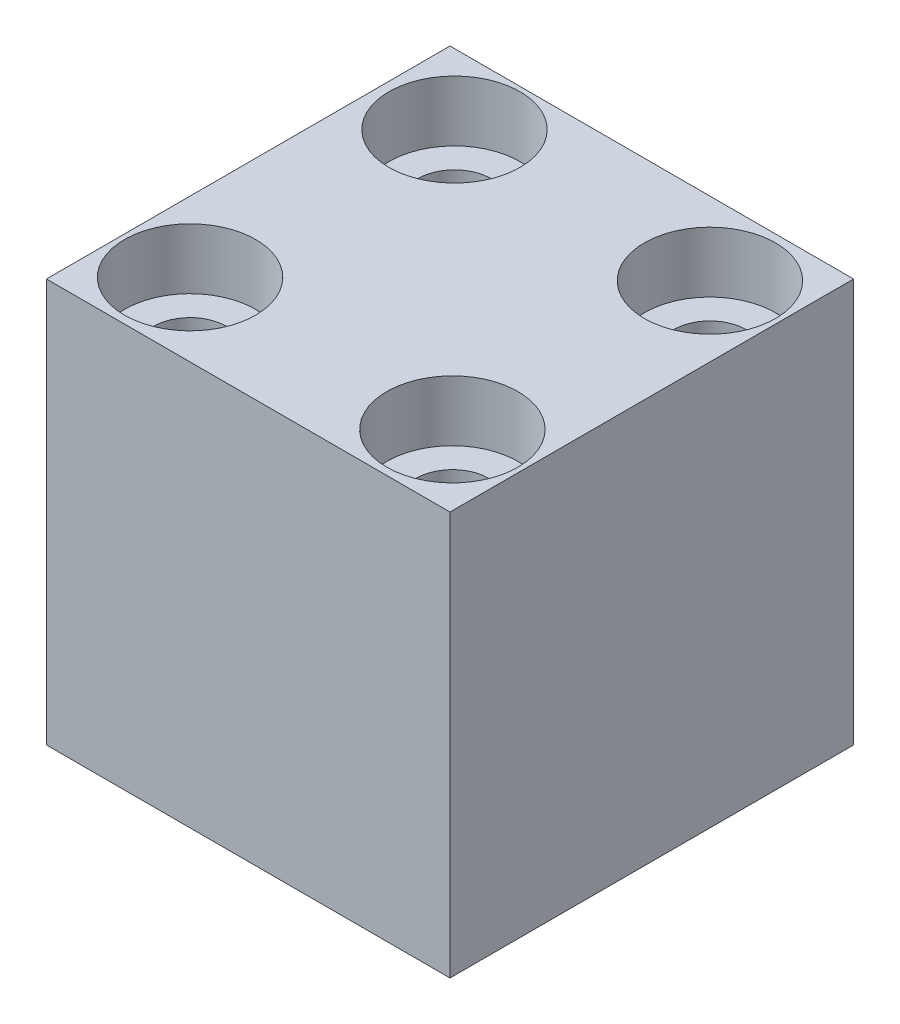
ISO-10303-21;
HEADER;
FILE_DESCRIPTION(('STEP AP214'),'2;1');
FILE_NAME('part.step','',(''),(''),'','','');
FILE_SCHEMA(('AUTOMOTIVE_DESIGN { 1 0 10303 214 1 1 1 1 }'));
ENDSEC;
DATA;
#1=APPLICATION_CONTEXT('core data for automotive mechanical design processes');
#2=APPLICATION_PROTOCOL_DEFINITION('international standard','automotive_design',2000,#1);
#3=PRODUCT_CONTEXT('',#1,'mechanical');
#4=PRODUCT('Part','Part','',(#3));
#5=PRODUCT_RELATED_PRODUCT_CATEGORY('part','',(#4));
#6=PRODUCT_DEFINITION_FORMATION('','',#4);
#7=PRODUCT_DEFINITION_CONTEXT('part definition',#1,'design');
#8=PRODUCT_DEFINITION('design','',#6,#7);
#9=PRODUCT_DEFINITION_SHAPE('','',#8);
#10=(LENGTH_UNIT() NAMED_UNIT(*) SI_UNIT(.MILLI.,.METRE.));
#11=(NAMED_UNIT(*) PLANE_ANGLE_UNIT() SI_UNIT($,.RADIAN.));
#12=(NAMED_UNIT(*) SI_UNIT($,.STERADIAN.) SOLID_ANGLE_UNIT());
#13=UNCERTAINTY_MEASURE_WITH_UNIT(LENGTH_MEASURE(1.E-05),#10,'distance_accuracy_value','');
#14=(GEOMETRIC_REPRESENTATION_CONTEXT(3) GLOBAL_UNCERTAINTY_ASSIGNED_CONTEXT((#13)) GLOBAL_UNIT_ASSIGNED_CONTEXT((#10,
#11,#12)) REPRESENTATION_CONTEXT('',''));
#15=CARTESIAN_POINT('',(0.,0.,0.));
#16=DIRECTION('',(0.,0.,1.));
#17=DIRECTION('',(1.,0.,0.));
#18=AXIS2_PLACEMENT_3D('',#15,#16,#17);
#19=CARTESIAN_POINT('',(0.,20.,0.));
#20=DIRECTION('',(0.,-1.,0.));
#21=DIRECTION('',(0.,0.,-1.));
#22=AXIS2_PLACEMENT_3D('',#19,#20,#21);
#23=PLANE('',#22);
#24=CARTESIAN_POINT('',(-6.3032422035321,20.,-6.5255557252335));
#25=DIRECTION('',(0.,1.,0.));
#26=DIRECTION('',(0.,0.,1.));
#27=AXIS2_PLACEMENT_3D('',#24,#25,#26);
#28=CIRCLE('',#27,3.25);
#29=CARTESIAN_POINT('',(-6.3032422035321,20.,-3.2755557252335));
#30=VERTEX_POINT('',#29);
#31=EDGE_CURVE('E155',#30,#30,#28,.T.);
#32=ORIENTED_EDGE('',*,*,#31,.F.);
#33=EDGE_LOOP('',(#32));
#34=FACE_BOUND('',#33,.T.);
#35=CARTESIAN_POINT('',(6.512478459251,20.,6.39478306540906));
#36=DIRECTION('',(0.,1.,0.));
#37=DIRECTION('',(0.,0.,1.));
#38=AXIS2_PLACEMENT_3D('',#35,#36,#37);
#39=CIRCLE('',#38,3.25);
#40=CARTESIAN_POINT('',(6.512478459251,20.,9.64478306540906));
#41=VERTEX_POINT('',#40);
#42=EDGE_CURVE('E131',#41,#41,#39,.T.);
#43=ORIENTED_EDGE('',*,*,#42,.F.);
#44=EDGE_LOOP('',(#43));
#45=FACE_BOUND('',#44,.T.);
#46=CARTESIAN_POINT('',(-6.51247845925101,20.,6.36862853344419));
#47=DIRECTION('',(0.,1.,0.));
#48=DIRECTION('',(0.,0.,1.));
#49=AXIS2_PLACEMENT_3D('',#46,#47,#48);
#50=CIRCLE('',#49,3.25);
#51=CARTESIAN_POINT('',(-6.51247845925101,20.,9.61862853344419));
#52=VERTEX_POINT('',#51);
#53=EDGE_CURVE('E119',#52,#52,#50,.T.);
#54=ORIENTED_EDGE('',*,*,#53,.F.);
#55=EDGE_LOOP('',(#54));
#56=FACE_BOUND('',#55,.T.);
#57=DIRECTION('',(0.,0.,-1.));
#58=VECTOR('',#57,1.);
#59=CARTESIAN_POINT('',(9.99999999999999,20.,10.));
#60=LINE('',#59,#58);
#61=CARTESIAN_POINT('',(9.99999999999999,20.,10.));
#62=VERTEX_POINT('',#61);
#63=CARTESIAN_POINT('',(9.99999999999999,20.,-9.99999999999999));
#64=VERTEX_POINT('',#63);
#65=EDGE_CURVE('E85',#62,#64,#60,.T.);
#66=ORIENTED_EDGE('',*,*,#65,.T.);
#67=DIRECTION('',(-1.,0.,0.));
#68=VECTOR('',#67,1.);
#69=CARTESIAN_POINT('',(-10.,20.,-9.99999999999999));
#70=LINE('',#69,#68);
#71=CARTESIAN_POINT('',(-10.,20.,-9.99999999999999));
#72=VERTEX_POINT('',#71);
#73=EDGE_CURVE('E80',#64,#72,#70,.T.);
#74=ORIENTED_EDGE('',*,*,#73,.T.);
#75=DIRECTION('',(0.,0.,1.));
#76=VECTOR('',#75,1.);
#77=CARTESIAN_POINT('',(-10.,20.,10.));
#78=LINE('',#77,#76);
#79=CARTESIAN_POINT('',(-10.,20.,10.));
#80=VERTEX_POINT('',#79);
#81=EDGE_CURVE('E83',#72,#80,#78,.T.);
#82=ORIENTED_EDGE('',*,*,#81,.T.);
#83=DIRECTION('',(1.,0.,0.));
#84=VECTOR('',#83,1.);
#85=CARTESIAN_POINT('',(-10.,20.,10.));
#86=LINE('',#85,#84);
#87=EDGE_CURVE('E50',#80,#62,#86,.T.);
#88=ORIENTED_EDGE('',*,*,#87,.T.);
#89=EDGE_LOOP('',(#66,#74,#82,#88));
#90=FACE_BOUND('',#89,.T.);
#91=CARTESIAN_POINT('',(6.512478459251,20.,-6.36862853344432));
#92=DIRECTION('',(0.,1.,0.));
#93=DIRECTION('',(0.,0.,1.));
#94=AXIS2_PLACEMENT_3D('',#91,#92,#93);
#95=CIRCLE('',#94,3.25);
#96=CARTESIAN_POINT('',(6.512478459251,20.,-3.11862853344432));
#97=VERTEX_POINT('',#96);
#98=EDGE_CURVE('E143',#97,#97,#95,.T.);
#99=ORIENTED_EDGE('',*,*,#98,.F.);
#100=EDGE_LOOP('',(#99));
#101=FACE_BOUND('',#100,.T.);
#102=ADVANCED_FACE('F33',(#34,#45,#56,#90,#101),#23,.F.);
#103=CARTESIAN_POINT('',(9.99999999999999,20.,10.));
#104=DIRECTION('',(-1.,0.,0.));
#105=DIRECTION('',(0.,0.,1.));
#106=AXIS2_PLACEMENT_3D('',#103,#104,#105);
#107=PLANE('',#106);
#108=DIRECTION('',(0.,0.,-1.));
#109=VECTOR('',#108,1.);
#110=CARTESIAN_POINT('',(9.99999999999999,0.,10.));
#111=LINE('',#110,#109);
#112=CARTESIAN_POINT('',(9.99999999999999,0.,10.));
#113=VERTEX_POINT('',#112);
#114=CARTESIAN_POINT('',(9.99999999999999,0.,-9.99999999999999));
#115=VERTEX_POINT('',#114);
#116=EDGE_CURVE('E97',#113,#115,#111,.T.);
#117=ORIENTED_EDGE('',*,*,#116,.T.);
#118=DIRECTION('',(0.,-1.,0.));
#119=VECTOR('',#118,1.);
#120=CARTESIAN_POINT('',(9.99999999999999,20.,-9.99999999999999));
#121=LINE('',#120,#119);
#122=EDGE_CURVE('E11',#64,#115,#121,.T.);
#123=ORIENTED_EDGE('',*,*,#122,.F.);
#124=ORIENTED_EDGE('',*,*,#65,.F.);
#125=DIRECTION('',(0.,-1.,0.));
#126=VECTOR('',#125,1.);
#127=CARTESIAN_POINT('',(9.99999999999999,20.,10.));
#128=LINE('',#127,#126);
#129=EDGE_CURVE('E93',#62,#113,#128,.T.);
#130=ORIENTED_EDGE('',*,*,#129,.T.);
#131=EDGE_LOOP('',(#117,#123,#124,#130));
#132=FACE_BOUND('',#131,.T.);
#133=ADVANCED_FACE('F35',(#132),#107,.F.);
#134=CARTESIAN_POINT('',(-10.,20.,-9.99999999999999));
#135=DIRECTION('',(0.,0.,1.));
#136=DIRECTION('',(1.,0.,0.));
#137=AXIS2_PLACEMENT_3D('',#134,#135,#136);
#138=PLANE('',#137);
#139=DIRECTION('',(-1.,0.,0.));
#140=VECTOR('',#139,1.);
#141=CARTESIAN_POINT('',(-10.,0.,-9.99999999999999));
#142=LINE('',#141,#140);
#143=CARTESIAN_POINT('',(-10.,0.,-9.99999999999999));
#144=VERTEX_POINT('',#143);
#145=EDGE_CURVE('E89',#115,#144,#142,.T.);
#146=ORIENTED_EDGE('',*,*,#145,.T.);
#147=DIRECTION('',(0.,-1.,0.));
#148=VECTOR('',#147,1.);
#149=CARTESIAN_POINT('',(-10.,20.,-9.99999999999999));
#150=LINE('',#149,#148);
#151=EDGE_CURVE('E42',#72,#144,#150,.T.);
#152=ORIENTED_EDGE('',*,*,#151,.F.);
#153=ORIENTED_EDGE('',*,*,#73,.F.);
#154=ORIENTED_EDGE('',*,*,#122,.T.);
#155=EDGE_LOOP('',(#146,#152,#153,#154));
#156=FACE_BOUND('',#155,.T.);
#157=ADVANCED_FACE('F88',(#156),#138,.F.);
#158=CARTESIAN_POINT('',(-10.,20.,10.));
#159=DIRECTION('',(1.,0.,0.));
#160=DIRECTION('',(0.,0.,-1.));
#161=AXIS2_PLACEMENT_3D('',#158,#159,#160);
#162=PLANE('',#161);
#163=DIRECTION('',(0.,0.,1.));
#164=VECTOR('',#163,1.);
#165=CARTESIAN_POINT('',(-10.,0.,10.));
#166=LINE('',#165,#164);
#167=CARTESIAN_POINT('',(-10.,0.,10.));
#168=VERTEX_POINT('',#167);
#169=EDGE_CURVE('E67',#144,#168,#166,.T.);
#170=ORIENTED_EDGE('',*,*,#169,.T.);
#171=DIRECTION('',(0.,-1.,0.));
#172=VECTOR('',#171,1.);
#173=CARTESIAN_POINT('',(-10.,20.,10.));
#174=LINE('',#173,#172);
#175=EDGE_CURVE('E90',#80,#168,#174,.T.);
#176=ORIENTED_EDGE('',*,*,#175,.F.);
#177=ORIENTED_EDGE('',*,*,#81,.F.);
#178=ORIENTED_EDGE('',*,*,#151,.T.);
#179=EDGE_LOOP('',(#170,#176,#177,#178));
#180=FACE_BOUND('',#179,.T.);
#181=ADVANCED_FACE('F91',(#180),#162,.F.);
#182=CARTESIAN_POINT('',(-10.,20.,10.));
#183=DIRECTION('',(0.,0.,-1.));
#184=DIRECTION('',(-1.,0.,0.));
#185=AXIS2_PLACEMENT_3D('',#182,#183,#184);
#186=PLANE('',#185);
#187=DIRECTION('',(1.,0.,0.));
#188=VECTOR('',#187,1.);
#189=CARTESIAN_POINT('',(-10.,0.,10.));
#190=LINE('',#189,#188);
#191=EDGE_CURVE('E73',#168,#113,#190,.T.);
#192=ORIENTED_EDGE('',*,*,#191,.T.);
#193=ORIENTED_EDGE('',*,*,#129,.F.);
#194=ORIENTED_EDGE('',*,*,#87,.F.);
#195=ORIENTED_EDGE('',*,*,#175,.T.);
#196=EDGE_LOOP('',(#192,#193,#194,#195));
#197=FACE_BOUND('',#196,.T.);
#198=ADVANCED_FACE('F105',(#197),#186,.F.);
#199=CARTESIAN_POINT('',(0.,0.,0.));
#200=DIRECTION('',(0.,-1.,0.));
#201=DIRECTION('',(0.,0.,-1.));
#202=AXIS2_PLACEMENT_3D('',#199,#200,#201);
#203=PLANE('',#202);
#204=CARTESIAN_POINT('',(-6.3032422035321,0.,-6.5255557252335));
#205=DIRECTION('',(0.,1.,0.));
#206=DIRECTION('',(0.,0.,1.));
#207=AXIS2_PLACEMENT_3D('',#204,#205,#206);
#208=CIRCLE('',#207,1.8);
#209=CARTESIAN_POINT('',(-6.3032422035321,0.,-4.7255557252335));
#210=VERTEX_POINT('',#209);
#211=EDGE_CURVE('E146',#210,#210,#208,.T.);
#212=ORIENTED_EDGE('',*,*,#211,.T.);
#213=EDGE_LOOP('',(#212));
#214=FACE_BOUND('',#213,.T.);
#215=CARTESIAN_POINT('',(6.512478459251,0.,-6.36862853344432));
#216=DIRECTION('',(0.,1.,0.));
#217=DIRECTION('',(0.,0.,1.));
#218=AXIS2_PLACEMENT_3D('',#215,#216,#217);
#219=CIRCLE('',#218,1.8);
#220=CARTESIAN_POINT('',(6.512478459251,0.,-4.56862853344432));
#221=VERTEX_POINT('',#220);
#222=EDGE_CURVE('E134',#221,#221,#219,.T.);
#223=ORIENTED_EDGE('',*,*,#222,.T.);
#224=EDGE_LOOP('',(#223));
#225=FACE_BOUND('',#224,.T.);
#226=CARTESIAN_POINT('',(6.512478459251,0.,6.39478306540906));
#227=DIRECTION('',(0.,1.,0.));
#228=DIRECTION('',(0.,0.,1.));
#229=AXIS2_PLACEMENT_3D('',#226,#227,#228);
#230=CIRCLE('',#229,1.8);
#231=CARTESIAN_POINT('',(6.512478459251,0.,8.19478306540905));
#232=VERTEX_POINT('',#231);
#233=EDGE_CURVE('E122',#232,#232,#230,.T.);
#234=ORIENTED_EDGE('',*,*,#233,.T.);
#235=EDGE_LOOP('',(#234));
#236=FACE_BOUND('',#235,.T.);
#237=CARTESIAN_POINT('',(-6.51247845925101,0.,6.36862853344419));
#238=DIRECTION('',(0.,1.,0.));
#239=DIRECTION('',(0.,0.,1.));
#240=AXIS2_PLACEMENT_3D('',#237,#238,#239);
#241=CIRCLE('',#240,1.8);
#242=CARTESIAN_POINT('',(-6.51247845925101,0.,8.16862853344419));
#243=VERTEX_POINT('',#242);
#244=EDGE_CURVE('E100',#243,#243,#241,.T.);
#245=ORIENTED_EDGE('',*,*,#244,.T.);
#246=EDGE_LOOP('',(#245));
#247=FACE_BOUND('',#246,.T.);
#248=ORIENTED_EDGE('',*,*,#116,.F.);
#249=ORIENTED_EDGE('',*,*,#191,.F.);
#250=ORIENTED_EDGE('',*,*,#169,.F.);
#251=ORIENTED_EDGE('',*,*,#145,.F.);
#252=EDGE_LOOP('',(#248,#249,#250,#251));
#253=FACE_BOUND('',#252,.T.);
#254=ADVANCED_FACE('F108',(#214,#225,#236,#247,#253),#203,.T.);
#255=CARTESIAN_POINT('',(-6.51247845925101,20.,6.36862853344419));
#256=DIRECTION('',(0.,1.,0.));
#257=DIRECTION('',(0.,0.,1.));
#258=AXIS2_PLACEMENT_3D('',#255,#256,#257);
#259=CYLINDRICAL_SURFACE('',#258,1.8);
#260=ORIENTED_EDGE('',*,*,#244,.F.);
#261=EDGE_LOOP('',(#260));
#262=FACE_BOUND('',#261,.T.);
#263=CARTESIAN_POINT('',(-6.51247845925101,17.,6.36862853344419));
#264=DIRECTION('',(0.,1.,0.));
#265=DIRECTION('',(0.,0.,1.));
#266=AXIS2_PLACEMENT_3D('',#263,#264,#265);
#267=CIRCLE('',#266,1.8);
#268=CARTESIAN_POINT('',(-6.51247845925101,17.,8.16862853344419));
#269=VERTEX_POINT('',#268);
#270=EDGE_CURVE('E113',#269,#269,#267,.T.);
#271=ORIENTED_EDGE('',*,*,#270,.T.);
#272=EDGE_LOOP('',(#271));
#273=FACE_BOUND('',#272,.T.);
#274=ADVANCED_FACE('F181',(#262,#273),#259,.F.);
#275=CARTESIAN_POINT('',(-4.71247845925101,17.,6.36862853344419));
#276=DIRECTION('',(0.,-1.,0.));
#277=DIRECTION('',(0.,0.,-1.));
#278=AXIS2_PLACEMENT_3D('',#275,#276,#277);
#279=PLANE('',#278);
#280=ORIENTED_EDGE('',*,*,#270,.F.);
#281=EDGE_LOOP('',(#280));
#282=FACE_BOUND('',#281,.T.);
#283=CARTESIAN_POINT('',(-6.51247845925101,17.,6.36862853344419));
#284=DIRECTION('',(0.,1.,0.));
#285=DIRECTION('',(0.,0.,1.));
#286=AXIS2_PLACEMENT_3D('',#283,#284,#285);
#287=CIRCLE('',#286,3.25);
#288=CARTESIAN_POINT('',(-6.51247845925101,17.,9.61862853344419));
#289=VERTEX_POINT('',#288);
#290=EDGE_CURVE('E116',#289,#289,#287,.T.);
#291=ORIENTED_EDGE('',*,*,#290,.T.);
#292=EDGE_LOOP('',(#291));
#293=FACE_BOUND('',#292,.T.);
#294=ADVANCED_FACE('F171',(#282,#293),#279,.F.);
#295=CARTESIAN_POINT('',(-6.51247845925101,20.,6.36862853344419));
#296=DIRECTION('',(0.,1.,0.));
#297=DIRECTION('',(0.,0.,1.));
#298=AXIS2_PLACEMENT_3D('',#295,#296,#297);
#299=CYLINDRICAL_SURFACE('',#298,3.25);
#300=ORIENTED_EDGE('',*,*,#290,.F.);
#301=EDGE_LOOP('',(#300));
#302=FACE_BOUND('',#301,.T.);
#303=ORIENTED_EDGE('',*,*,#53,.T.);
#304=EDGE_LOOP('',(#303));
#305=FACE_BOUND('',#304,.T.);
#306=ADVANCED_FACE('F168',(#302,#305),#299,.F.);
#307=CARTESIAN_POINT('',(6.512478459251,20.,6.39478306540906));
#308=DIRECTION('',(0.,1.,0.));
#309=DIRECTION('',(0.,0.,1.));
#310=AXIS2_PLACEMENT_3D('',#307,#308,#309);
#311=CYLINDRICAL_SURFACE('',#310,1.8);
#312=ORIENTED_EDGE('',*,*,#233,.F.);
#313=EDGE_LOOP('',(#312));
#314=FACE_BOUND('',#313,.T.);
#315=CARTESIAN_POINT('',(6.512478459251,17.,6.39478306540906));
#316=DIRECTION('',(0.,1.,0.));
#317=DIRECTION('',(0.,0.,1.));
#318=AXIS2_PLACEMENT_3D('',#315,#316,#317);
#319=CIRCLE('',#318,1.8);
#320=CARTESIAN_POINT('',(6.512478459251,17.,8.19478306540906));
#321=VERTEX_POINT('',#320);
#322=EDGE_CURVE('E125',#321,#321,#319,.T.);
#323=ORIENTED_EDGE('',*,*,#322,.T.);
#324=EDGE_LOOP('',(#323));
#325=FACE_BOUND('',#324,.T.);
#326=ADVANCED_FACE('F170',(#314,#325),#311,.F.);
#327=CARTESIAN_POINT('',(8.312478459251,17.,6.39478306540906));
#328=DIRECTION('',(0.,-1.,0.));
#329=DIRECTION('',(0.,0.,-1.));
#330=AXIS2_PLACEMENT_3D('',#327,#328,#329);
#331=PLANE('',#330);
#332=ORIENTED_EDGE('',*,*,#322,.F.);
#333=EDGE_LOOP('',(#332));
#334=FACE_BOUND('',#333,.T.);
#335=CARTESIAN_POINT('',(6.512478459251,17.,6.39478306540906));
#336=DIRECTION('',(0.,1.,0.));
#337=DIRECTION('',(0.,0.,1.));
#338=AXIS2_PLACEMENT_3D('',#335,#336,#337);
#339=CIRCLE('',#338,3.25);
#340=CARTESIAN_POINT('',(6.512478459251,17.,9.64478306540906));
#341=VERTEX_POINT('',#340);
#342=EDGE_CURVE('E128',#341,#341,#339,.T.);
#343=ORIENTED_EDGE('',*,*,#342,.T.);
#344=EDGE_LOOP('',(#343));
#345=FACE_BOUND('',#344,.T.);
#346=ADVANCED_FACE('F178',(#334,#345),#331,.F.);
#347=CARTESIAN_POINT('',(6.512478459251,20.,6.39478306540906));
#348=DIRECTION('',(0.,1.,0.));
#349=DIRECTION('',(0.,0.,1.));
#350=AXIS2_PLACEMENT_3D('',#347,#348,#349);
#351=CYLINDRICAL_SURFACE('',#350,3.25);
#352=ORIENTED_EDGE('',*,*,#342,.F.);
#353=EDGE_LOOP('',(#352));
#354=FACE_BOUND('',#353,.T.);
#355=ORIENTED_EDGE('',*,*,#42,.T.);
#356=EDGE_LOOP('',(#355));
#357=FACE_BOUND('',#356,.T.);
#358=ADVANCED_FACE('F247',(#354,#357),#351,.F.);
#359=CARTESIAN_POINT('',(6.512478459251,20.,-6.36862853344432));
#360=DIRECTION('',(0.,1.,0.));
#361=DIRECTION('',(0.,0.,1.));
#362=AXIS2_PLACEMENT_3D('',#359,#360,#361);
#363=CYLINDRICAL_SURFACE('',#362,1.8);
#364=ORIENTED_EDGE('',*,*,#222,.F.);
#365=EDGE_LOOP('',(#364));
#366=FACE_BOUND('',#365,.T.);
#367=CARTESIAN_POINT('',(6.512478459251,17.,-6.36862853344432));
#368=DIRECTION('',(0.,1.,0.));
#369=DIRECTION('',(0.,0.,1.));
#370=AXIS2_PLACEMENT_3D('',#367,#368,#369);
#371=CIRCLE('',#370,1.8);
#372=CARTESIAN_POINT('',(6.512478459251,17.,-4.56862853344432));
#373=VERTEX_POINT('',#372);
#374=EDGE_CURVE('E137',#373,#373,#371,.T.);
#375=ORIENTED_EDGE('',*,*,#374,.T.);
#376=EDGE_LOOP('',(#375));
#377=FACE_BOUND('',#376,.T.);
#378=ADVANCED_FACE('F256',(#366,#377),#363,.F.);
#379=CARTESIAN_POINT('',(8.312478459251,17.,-6.36862853344432));
#380=DIRECTION('',(0.,-1.,0.));
#381=DIRECTION('',(0.,0.,-1.));
#382=AXIS2_PLACEMENT_3D('',#379,#380,#381);
#383=PLANE('',#382);
#384=ORIENTED_EDGE('',*,*,#374,.F.);
#385=EDGE_LOOP('',(#384));
#386=FACE_BOUND('',#385,.T.);
#387=CARTESIAN_POINT('',(6.512478459251,17.,-6.36862853344432));
#388=DIRECTION('',(0.,1.,0.));
#389=DIRECTION('',(0.,0.,1.));
#390=AXIS2_PLACEMENT_3D('',#387,#388,#389);
#391=CIRCLE('',#390,3.25);
#392=CARTESIAN_POINT('',(6.512478459251,17.,-3.11862853344432));
#393=VERTEX_POINT('',#392);
#394=EDGE_CURVE('E140',#393,#393,#391,.T.);
#395=ORIENTED_EDGE('',*,*,#394,.T.);
#396=EDGE_LOOP('',(#395));
#397=FACE_BOUND('',#396,.T.);
#398=ADVANCED_FACE('F266',(#386,#397),#383,.F.);
#399=CARTESIAN_POINT('',(6.512478459251,20.,-6.36862853344432));
#400=DIRECTION('',(0.,1.,0.));
#401=DIRECTION('',(0.,0.,1.));
#402=AXIS2_PLACEMENT_3D('',#399,#400,#401);
#403=CYLINDRICAL_SURFACE('',#402,3.25);
#404=ORIENTED_EDGE('',*,*,#394,.F.);
#405=EDGE_LOOP('',(#404));
#406=FACE_BOUND('',#405,.T.);
#407=ORIENTED_EDGE('',*,*,#98,.T.);
#408=EDGE_LOOP('',(#407));
#409=FACE_BOUND('',#408,.T.);
#410=ADVANCED_FACE('F276',(#406,#409),#403,.F.);
#411=CARTESIAN_POINT('',(-6.3032422035321,20.,-6.5255557252335));
#412=DIRECTION('',(0.,1.,0.));
#413=DIRECTION('',(0.,0.,1.));
#414=AXIS2_PLACEMENT_3D('',#411,#412,#413);
#415=CYLINDRICAL_SURFACE('',#414,1.8);
#416=ORIENTED_EDGE('',*,*,#211,.F.);
#417=EDGE_LOOP('',(#416));
#418=FACE_BOUND('',#417,.T.);
#419=CARTESIAN_POINT('',(-6.3032422035321,17.,-6.5255557252335));
#420=DIRECTION('',(0.,1.,0.));
#421=DIRECTION('',(0.,0.,1.));
#422=AXIS2_PLACEMENT_3D('',#419,#420,#421);
#423=CIRCLE('',#422,1.8);
#424=CARTESIAN_POINT('',(-6.3032422035321,17.,-4.7255557252335));
#425=VERTEX_POINT('',#424);
#426=EDGE_CURVE('E149',#425,#425,#423,.T.);
#427=ORIENTED_EDGE('',*,*,#426,.T.);
#428=EDGE_LOOP('',(#427));
#429=FACE_BOUND('',#428,.T.);
#430=ADVANCED_FACE('F286',(#418,#429),#415,.F.);
#431=CARTESIAN_POINT('',(-4.5032422035321,17.,-6.5255557252335));
#432=DIRECTION('',(0.,-1.,0.));
#433=DIRECTION('',(0.,0.,-1.));
#434=AXIS2_PLACEMENT_3D('',#431,#432,#433);
#435=PLANE('',#434);
#436=ORIENTED_EDGE('',*,*,#426,.F.);
#437=EDGE_LOOP('',(#436));
#438=FACE_BOUND('',#437,.T.);
#439=CARTESIAN_POINT('',(-6.3032422035321,17.,-6.5255557252335));
#440=DIRECTION('',(0.,1.,0.));
#441=DIRECTION('',(0.,0.,1.));
#442=AXIS2_PLACEMENT_3D('',#439,#440,#441);
#443=CIRCLE('',#442,3.25);
#444=CARTESIAN_POINT('',(-6.3032422035321,17.,-3.2755557252335));
#445=VERTEX_POINT('',#444);
#446=EDGE_CURVE('E152',#445,#445,#443,.T.);
#447=ORIENTED_EDGE('',*,*,#446,.T.);
#448=EDGE_LOOP('',(#447));
#449=FACE_BOUND('',#448,.T.);
#450=ADVANCED_FACE('F296',(#438,#449),#435,.F.);
#451=CARTESIAN_POINT('',(-6.3032422035321,20.,-6.5255557252335));
#452=DIRECTION('',(0.,1.,0.));
#453=DIRECTION('',(0.,0.,1.));
#454=AXIS2_PLACEMENT_3D('',#451,#452,#453);
#455=CYLINDRICAL_SURFACE('',#454,3.25);
#456=ORIENTED_EDGE('',*,*,#446,.F.);
#457=EDGE_LOOP('',(#456));
#458=FACE_BOUND('',#457,.T.);
#459=ORIENTED_EDGE('',*,*,#31,.T.);
#460=EDGE_LOOP('',(#459));
#461=FACE_BOUND('',#460,.T.);
#462=ADVANCED_FACE('F159',(#458,#461),#455,.F.);
#463=CLOSED_SHELL('',(#102,#133,#157,#181,#198,#254,#274,#294,#306,#326,#346,#358,#378,#398,
#410,#430,#450,#462));
#464=MANIFOLD_SOLID_BREP('B2',#463);
#465=ADVANCED_BREP_SHAPE_REPRESENTATION('',(#18,#464),#14);
#466=SHAPE_DEFINITION_REPRESENTATION(#9,#465);
ENDSEC;
END-ISO-10303-21;
